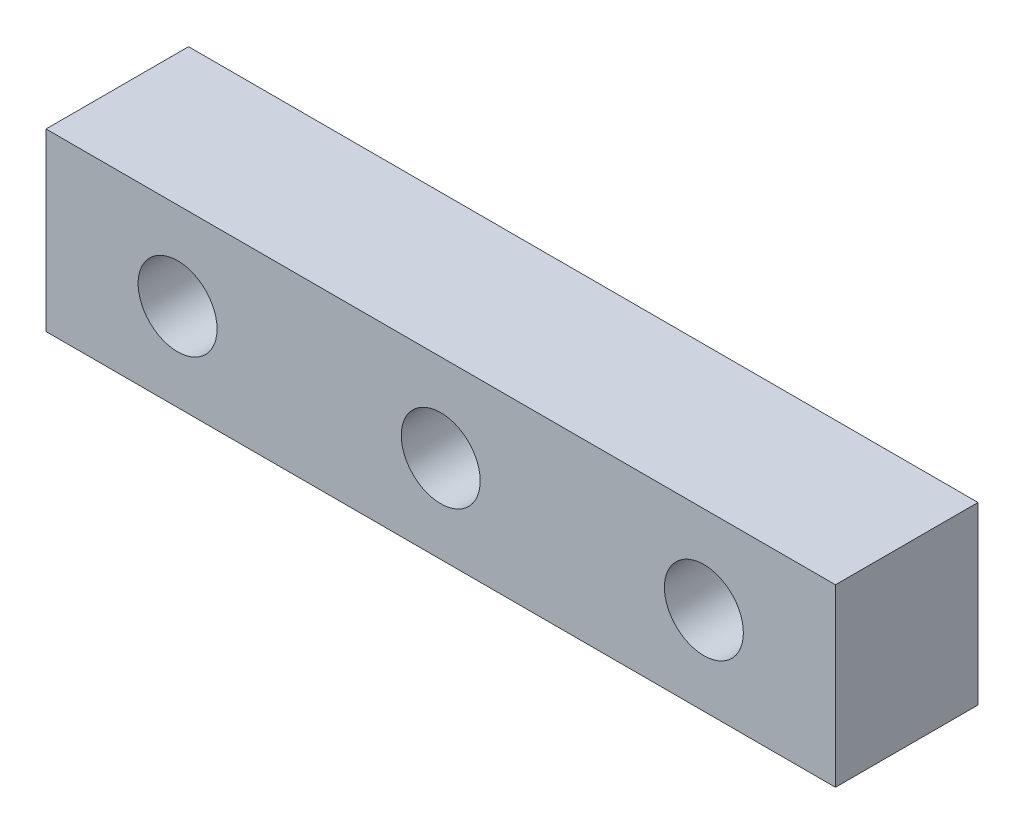
ISO-10303-21;
HEADER;
FILE_DESCRIPTION(('STEP AP214'),'2;1');
FILE_NAME('part.step','',(''),(''),'','','');
FILE_SCHEMA(('AUTOMOTIVE_DESIGN { 1 0 10303 214 1 1 1 1 }'));
ENDSEC;
DATA;
#1=APPLICATION_CONTEXT('core data for automotive mechanical design processes');
#2=APPLICATION_PROTOCOL_DEFINITION('international standard','automotive_design',2000,#1);
#3=PRODUCT_CONTEXT('',#1,'mechanical');
#4=PRODUCT('Part','Part','',(#3));
#5=PRODUCT_RELATED_PRODUCT_CATEGORY('part','',(#4));
#6=PRODUCT_DEFINITION_FORMATION('','',#4);
#7=PRODUCT_DEFINITION_CONTEXT('part definition',#1,'design');
#8=PRODUCT_DEFINITION('design','',#6,#7);
#9=PRODUCT_DEFINITION_SHAPE('','',#8);
#10=(LENGTH_UNIT() NAMED_UNIT(*) SI_UNIT(.MILLI.,.METRE.));
#11=(NAMED_UNIT(*) PLANE_ANGLE_UNIT() SI_UNIT($,.RADIAN.));
#12=(NAMED_UNIT(*) SI_UNIT($,.STERADIAN.) SOLID_ANGLE_UNIT());
#13=UNCERTAINTY_MEASURE_WITH_UNIT(LENGTH_MEASURE(1.E-05),#10,'distance_accuracy_value','');
#14=(GEOMETRIC_REPRESENTATION_CONTEXT(3) GLOBAL_UNCERTAINTY_ASSIGNED_CONTEXT((#13)) GLOBAL_UNIT_ASSIGNED_CONTEXT((#10,
#11,#12)) REPRESENTATION_CONTEXT('',''));
#15=CARTESIAN_POINT('',(0.,0.,0.));
#16=DIRECTION('',(0.,0.,1.));
#17=DIRECTION('',(1.,0.,0.));
#18=AXIS2_PLACEMENT_3D('',#15,#16,#17);
#19=CARTESIAN_POINT('',(0.,0.,16.25));
#20=DIRECTION('',(0.,0.,1.));
#21=DIRECTION('',(1.,0.,0.));
#22=AXIS2_PLACEMENT_3D('',#19,#20,#21);
#23=PLANE('',#22);
#24=CARTESIAN_POINT('',(0.,0.,16.25));
#25=DIRECTION('',(0.,0.,1.));
#26=DIRECTION('',(1.,0.,0.));
#27=AXIS2_PLACEMENT_3D('',#24,#25,#26);
#28=CIRCLE('',#27,4.5);
#29=CARTESIAN_POINT('',(4.49999999999999,0.,16.25));
#30=VERTEX_POINT('',#29);
#31=EDGE_CURVE('E118',#30,#30,#28,.T.);
#32=ORIENTED_EDGE('',*,*,#31,.F.);
#33=EDGE_LOOP('',(#32));
#34=FACE_BOUND('',#33,.T.);
#35=DIRECTION('',(0.,1.,0.));
#36=VECTOR('',#35,1.);
#37=CARTESIAN_POINT('',(45.,10.,16.25));
#38=LINE('',#37,#36);
#39=CARTESIAN_POINT('',(45.,-10.,16.25));
#40=VERTEX_POINT('',#39);
#41=CARTESIAN_POINT('',(45.,10.,16.25));
#42=VERTEX_POINT('',#41);
#43=EDGE_CURVE('E88',#40,#42,#38,.T.);
#44=ORIENTED_EDGE('',*,*,#43,.T.);
#45=DIRECTION('',(-1.,0.,0.));
#46=VECTOR('',#45,1.);
#47=CARTESIAN_POINT('',(-45.,10.,16.25));
#48=LINE('',#47,#46);
#49=CARTESIAN_POINT('',(-45.,10.,16.25));
#50=VERTEX_POINT('',#49);
#51=EDGE_CURVE('E83',#42,#50,#48,.T.);
#52=ORIENTED_EDGE('',*,*,#51,.T.);
#53=DIRECTION('',(0.,-1.,0.));
#54=VECTOR('',#53,1.);
#55=CARTESIAN_POINT('',(-45.,10.,16.25));
#56=LINE('',#55,#54);
#57=CARTESIAN_POINT('',(-45.,-10.,16.25));
#58=VERTEX_POINT('',#57);
#59=EDGE_CURVE('E86',#50,#58,#56,.T.);
#60=ORIENTED_EDGE('',*,*,#59,.T.);
#61=DIRECTION('',(1.,0.,0.));
#62=VECTOR('',#61,1.);
#63=CARTESIAN_POINT('',(-45.,-10.,16.25));
#64=LINE('',#63,#62);
#65=EDGE_CURVE('E53',#58,#40,#64,.T.);
#66=ORIENTED_EDGE('',*,*,#65,.T.);
#67=EDGE_LOOP('',(#44,#52,#60,#66));
#68=FACE_BOUND('',#67,.T.);
#69=CARTESIAN_POINT('',(-30.,0.,16.25));
#70=DIRECTION('',(0.,0.,1.));
#71=DIRECTION('',(1.,0.,0.));
#72=AXIS2_PLACEMENT_3D('',#69,#70,#71);
#73=CIRCLE('',#72,4.5);
#74=CARTESIAN_POINT('',(-25.5,0.,16.25));
#75=VERTEX_POINT('',#74);
#76=EDGE_CURVE('E103',#75,#75,#73,.T.);
#77=ORIENTED_EDGE('',*,*,#76,.F.);
#78=EDGE_LOOP('',(#77));
#79=FACE_BOUND('',#78,.T.);
#80=CARTESIAN_POINT('',(30.,0.,16.25));
#81=DIRECTION('',(0.,0.,1.));
#82=DIRECTION('',(1.,0.,0.));
#83=AXIS2_PLACEMENT_3D('',#80,#81,#82);
#84=CIRCLE('',#83,4.5);
#85=CARTESIAN_POINT('',(34.5,0.,16.25));
#86=VERTEX_POINT('',#85);
#87=EDGE_CURVE('E124',#86,#86,#84,.T.);
#88=ORIENTED_EDGE('',*,*,#87,.F.);
#89=EDGE_LOOP('',(#88));
#90=FACE_BOUND('',#89,.T.);
#91=ADVANCED_FACE('F36',(#34,#68,#79,#90),#23,.T.);
#92=CARTESIAN_POINT('',(0.,0.,0.));
#93=DIRECTION('',(0.,0.,1.));
#94=DIRECTION('',(1.,0.,0.));
#95=AXIS2_PLACEMENT_3D('',#92,#93,#94);
#96=PLANE('',#95);
#97=DIRECTION('',(0.,1.,0.));
#98=VECTOR('',#97,1.);
#99=CARTESIAN_POINT('',(45.,10.,0.));
#100=LINE('',#99,#98);
#101=CARTESIAN_POINT('',(45.,-10.,0.));
#102=VERTEX_POINT('',#101);
#103=CARTESIAN_POINT('',(45.,10.,0.));
#104=VERTEX_POINT('',#103);
#105=EDGE_CURVE('E100',#102,#104,#100,.T.);
#106=ORIENTED_EDGE('',*,*,#105,.F.);
#107=DIRECTION('',(1.,0.,0.));
#108=VECTOR('',#107,1.);
#109=CARTESIAN_POINT('',(-45.,-10.,0.));
#110=LINE('',#109,#108);
#111=CARTESIAN_POINT('',(-45.,-10.,0.));
#112=VERTEX_POINT('',#111);
#113=EDGE_CURVE('E76',#112,#102,#110,.T.);
#114=ORIENTED_EDGE('',*,*,#113,.F.);
#115=DIRECTION('',(0.,-1.,0.));
#116=VECTOR('',#115,1.);
#117=CARTESIAN_POINT('',(-45.,10.,0.));
#118=LINE('',#117,#116);
#119=CARTESIAN_POINT('',(-45.,10.,0.));
#120=VERTEX_POINT('',#119);
#121=EDGE_CURVE('E70',#120,#112,#118,.T.);
#122=ORIENTED_EDGE('',*,*,#121,.F.);
#123=DIRECTION('',(-1.,0.,0.));
#124=VECTOR('',#123,1.);
#125=CARTESIAN_POINT('',(-45.,10.,0.));
#126=LINE('',#125,#124);
#127=EDGE_CURVE('E92',#104,#120,#126,.T.);
#128=ORIENTED_EDGE('',*,*,#127,.F.);
#129=EDGE_LOOP('',(#106,#114,#122,#128));
#130=FACE_BOUND('',#129,.T.);
#131=CARTESIAN_POINT('',(-30.,0.,0.));
#132=DIRECTION('',(0.,0.,1.));
#133=DIRECTION('',(1.,0.,0.));
#134=AXIS2_PLACEMENT_3D('',#131,#132,#133);
#135=CIRCLE('',#134,4.5);
#136=CARTESIAN_POINT('',(-25.5,0.,0.));
#137=VERTEX_POINT('',#136);
#138=EDGE_CURVE('E115',#137,#137,#135,.T.);
#139=ORIENTED_EDGE('',*,*,#138,.T.);
#140=EDGE_LOOP('',(#139));
#141=FACE_BOUND('',#140,.T.);
#142=CARTESIAN_POINT('',(0.,0.,0.));
#143=DIRECTION('',(0.,0.,1.));
#144=DIRECTION('',(1.,0.,0.));
#145=AXIS2_PLACEMENT_3D('',#142,#143,#144);
#146=CIRCLE('',#145,4.5);
#147=CARTESIAN_POINT('',(4.49999999999999,0.,0.));
#148=VERTEX_POINT('',#147);
#149=EDGE_CURVE('E121',#148,#148,#146,.T.);
#150=ORIENTED_EDGE('',*,*,#149,.T.);
#151=EDGE_LOOP('',(#150));
#152=FACE_BOUND('',#151,.T.);
#153=CARTESIAN_POINT('',(30.,0.,0.));
#154=DIRECTION('',(0.,0.,1.));
#155=DIRECTION('',(1.,0.,0.));
#156=AXIS2_PLACEMENT_3D('',#153,#154,#155);
#157=CIRCLE('',#156,4.5);
#158=CARTESIAN_POINT('',(34.5,0.,0.));
#159=VERTEX_POINT('',#158);
#160=EDGE_CURVE('E127',#159,#159,#157,.T.);
#161=ORIENTED_EDGE('',*,*,#160,.T.);
#162=EDGE_LOOP('',(#161));
#163=FACE_BOUND('',#162,.T.);
#164=ADVANCED_FACE('F111',(#130,#141,#152,#163),#96,.F.);
#165=CARTESIAN_POINT('',(45.,10.,16.25));
#166=DIRECTION('',(-1.,0.,0.));
#167=DIRECTION('',(0.,0.,1.));
#168=AXIS2_PLACEMENT_3D('',#165,#166,#167);
#169=PLANE('',#168);
#170=ORIENTED_EDGE('',*,*,#105,.T.);
#171=DIRECTION('',(0.,0.,-1.));
#172=VECTOR('',#171,1.);
#173=CARTESIAN_POINT('',(45.,10.,16.25));
#174=LINE('',#173,#172);
#175=EDGE_CURVE('E11',#42,#104,#174,.T.);
#176=ORIENTED_EDGE('',*,*,#175,.F.);
#177=ORIENTED_EDGE('',*,*,#43,.F.);
#178=DIRECTION('',(0.,0.,-1.));
#179=VECTOR('',#178,1.);
#180=CARTESIAN_POINT('',(45.,-10.,16.25));
#181=LINE('',#180,#179);
#182=EDGE_CURVE('E96',#40,#102,#181,.T.);
#183=ORIENTED_EDGE('',*,*,#182,.T.);
#184=EDGE_LOOP('',(#170,#176,#177,#183));
#185=FACE_BOUND('',#184,.T.);
#186=ADVANCED_FACE('F38',(#185),#169,.F.);
#187=CARTESIAN_POINT('',(-45.,10.,16.25));
#188=DIRECTION('',(0.,-1.,0.));
#189=DIRECTION('',(1.,0.,0.));
#190=AXIS2_PLACEMENT_3D('',#187,#188,#189);
#191=PLANE('',#190);
#192=ORIENTED_EDGE('',*,*,#127,.T.);
#193=DIRECTION('',(0.,0.,-1.));
#194=VECTOR('',#193,1.);
#195=CARTESIAN_POINT('',(-45.,10.,16.25));
#196=LINE('',#195,#194);
#197=EDGE_CURVE('E45',#50,#120,#196,.T.);
#198=ORIENTED_EDGE('',*,*,#197,.F.);
#199=ORIENTED_EDGE('',*,*,#51,.F.);
#200=ORIENTED_EDGE('',*,*,#175,.T.);
#201=EDGE_LOOP('',(#192,#198,#199,#200));
#202=FACE_BOUND('',#201,.T.);
#203=ADVANCED_FACE('F91',(#202),#191,.F.);
#204=CARTESIAN_POINT('',(-45.,10.,16.25));
#205=DIRECTION('',(1.,0.,0.));
#206=DIRECTION('',(0.,0.,-1.));
#207=AXIS2_PLACEMENT_3D('',#204,#205,#206);
#208=PLANE('',#207);
#209=ORIENTED_EDGE('',*,*,#121,.T.);
#210=DIRECTION('',(0.,0.,-1.));
#211=VECTOR('',#210,1.);
#212=CARTESIAN_POINT('',(-45.,-10.,16.25));
#213=LINE('',#212,#211);
#214=EDGE_CURVE('E93',#58,#112,#213,.T.);
#215=ORIENTED_EDGE('',*,*,#214,.F.);
#216=ORIENTED_EDGE('',*,*,#59,.F.);
#217=ORIENTED_EDGE('',*,*,#197,.T.);
#218=EDGE_LOOP('',(#209,#215,#216,#217));
#219=FACE_BOUND('',#218,.T.);
#220=ADVANCED_FACE('F94',(#219),#208,.F.);
#221=CARTESIAN_POINT('',(-45.,-10.,16.25));
#222=DIRECTION('',(0.,1.,0.));
#223=DIRECTION('',(0.,0.,1.));
#224=AXIS2_PLACEMENT_3D('',#221,#222,#223);
#225=PLANE('',#224);
#226=ORIENTED_EDGE('',*,*,#113,.T.);
#227=ORIENTED_EDGE('',*,*,#182,.F.);
#228=ORIENTED_EDGE('',*,*,#65,.F.);
#229=ORIENTED_EDGE('',*,*,#214,.T.);
#230=EDGE_LOOP('',(#226,#227,#228,#229));
#231=FACE_BOUND('',#230,.T.);
#232=ADVANCED_FACE('F108',(#231),#225,.F.);
#233=CARTESIAN_POINT('',(-30.,0.,16.25));
#234=DIRECTION('',(0.,0.,-1.));
#235=DIRECTION('',(-1.,0.,0.));
#236=AXIS2_PLACEMENT_3D('',#233,#234,#235);
#237=CYLINDRICAL_SURFACE('',#236,4.5);
#238=ORIENTED_EDGE('',*,*,#76,.T.);
#239=EDGE_LOOP('',(#238));
#240=FACE_BOUND('',#239,.T.);
#241=ORIENTED_EDGE('',*,*,#138,.F.);
#242=EDGE_LOOP('',(#241));
#243=FACE_BOUND('',#242,.T.);
#244=ADVANCED_FACE('F145',(#240,#243),#237,.F.);
#245=CARTESIAN_POINT('',(0.,0.,16.25));
#246=DIRECTION('',(0.,0.,-1.));
#247=DIRECTION('',(-1.,0.,0.));
#248=AXIS2_PLACEMENT_3D('',#245,#246,#247);
#249=CYLINDRICAL_SURFACE('',#248,4.5);
#250=ORIENTED_EDGE('',*,*,#31,.T.);
#251=EDGE_LOOP('',(#250));
#252=FACE_BOUND('',#251,.T.);
#253=ORIENTED_EDGE('',*,*,#149,.F.);
#254=EDGE_LOOP('',(#253));
#255=FACE_BOUND('',#254,.T.);
#256=ADVANCED_FACE('F191',(#252,#255),#249,.F.);
#257=CARTESIAN_POINT('',(30.,0.,16.25));
#258=DIRECTION('',(0.,0.,-1.));
#259=DIRECTION('',(-1.,0.,0.));
#260=AXIS2_PLACEMENT_3D('',#257,#258,#259);
#261=CYLINDRICAL_SURFACE('',#260,4.5);
#262=ORIENTED_EDGE('',*,*,#87,.T.);
#263=EDGE_LOOP('',(#262));
#264=FACE_BOUND('',#263,.T.);
#265=ORIENTED_EDGE('',*,*,#160,.F.);
#266=EDGE_LOOP('',(#265));
#267=FACE_BOUND('',#266,.T.);
#268=ADVANCED_FACE('F133',(#264,#267),#261,.F.);
#269=CLOSED_SHELL('',(#91,#164,#186,#203,#220,#232,#244,#256,#268));
#270=MANIFOLD_SOLID_BREP('B2',#269);
#271=ADVANCED_BREP_SHAPE_REPRESENTATION('',(#18,#270),#14);
#272=SHAPE_DEFINITION_REPRESENTATION(#9,#271);
ENDSEC;
END-ISO-10303-21;
